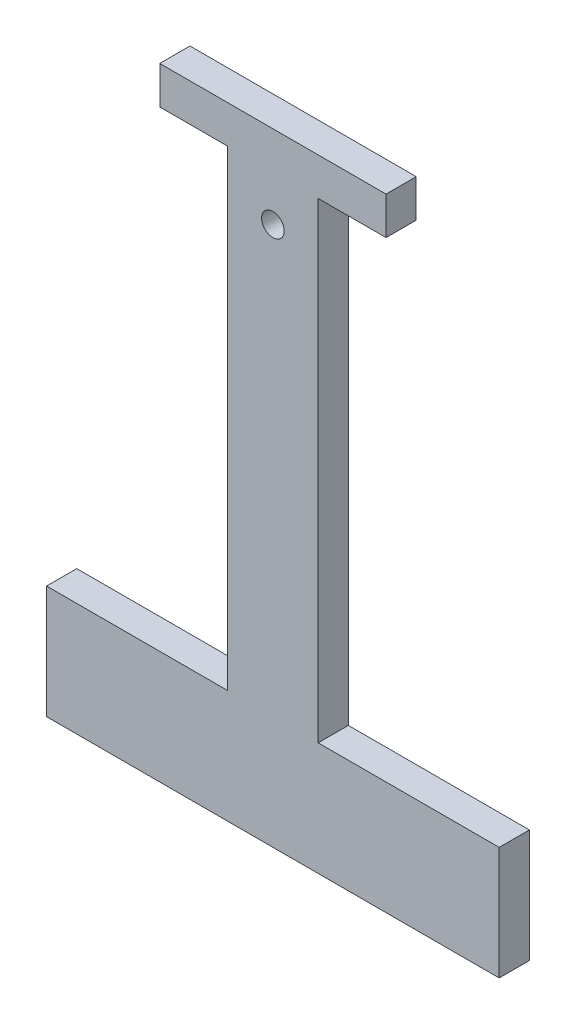
ISO-10303-21;
HEADER;
FILE_DESCRIPTION(('STEP AP214'),'2;1');
FILE_NAME('part.step','',(''),(''),'','','');
FILE_SCHEMA(('AUTOMOTIVE_DESIGN { 1 0 10303 214 1 1 1 1 }'));
ENDSEC;
DATA;
#1=APPLICATION_CONTEXT('core data for automotive mechanical design processes');
#2=APPLICATION_PROTOCOL_DEFINITION('international standard','automotive_design',2000,#1);
#3=PRODUCT_CONTEXT('',#1,'mechanical');
#4=PRODUCT('Part','Part','',(#3));
#5=PRODUCT_RELATED_PRODUCT_CATEGORY('part','',(#4));
#6=PRODUCT_DEFINITION_FORMATION('','',#4);
#7=PRODUCT_DEFINITION_CONTEXT('part definition',#1,'design');
#8=PRODUCT_DEFINITION('design','',#6,#7);
#9=PRODUCT_DEFINITION_SHAPE('','',#8);
#10=(LENGTH_UNIT() NAMED_UNIT(*) SI_UNIT(.MILLI.,.METRE.));
#11=(NAMED_UNIT(*) PLANE_ANGLE_UNIT() SI_UNIT($,.RADIAN.));
#12=(NAMED_UNIT(*) SI_UNIT($,.STERADIAN.) SOLID_ANGLE_UNIT());
#13=UNCERTAINTY_MEASURE_WITH_UNIT(LENGTH_MEASURE(1.E-05),#10,'distance_accuracy_value','');
#14=(GEOMETRIC_REPRESENTATION_CONTEXT(3) GLOBAL_UNCERTAINTY_ASSIGNED_CONTEXT((#13)) GLOBAL_UNIT_ASSIGNED_CONTEXT((#10,
#11,#12)) REPRESENTATION_CONTEXT('',''));
#15=CARTESIAN_POINT('',(0.,0.,0.));
#16=DIRECTION('',(0.,0.,1.));
#17=DIRECTION('',(1.,0.,0.));
#18=AXIS2_PLACEMENT_3D('',#15,#16,#17);
#19=CARTESIAN_POINT('',(0.,0.,4.));
#20=DIRECTION('',(0.,0.,1.));
#21=DIRECTION('',(1.,0.,0.));
#22=AXIS2_PLACEMENT_3D('',#19,#20,#21);
#23=PLANE('',#22);
#24=DIRECTION('',(-1.,0.,0.));
#25=VECTOR('',#24,1.);
#26=CARTESIAN_POINT('',(5.70816552104222,7.5,4.));
#27=LINE('',#26,#25);
#28=CARTESIAN_POINT('',(29.7081655210422,7.5,4.));
#29=VERTEX_POINT('',#28);
#30=CARTESIAN_POINT('',(5.70816552104222,7.5,4.));
#31=VERTEX_POINT('',#30);
#32=EDGE_CURVE('E200',#29,#31,#27,.T.);
#33=ORIENTED_EDGE('',*,*,#32,.T.);
#34=DIRECTION('',(0.,1.,0.));
#35=VECTOR('',#34,1.);
#36=CARTESIAN_POINT('',(5.70816552104222,7.5,4.));
#37=LINE('',#36,#35);
#38=CARTESIAN_POINT('',(5.70816552104222,70.,4.));
#39=VERTEX_POINT('',#38);
#40=EDGE_CURVE('E112',#31,#39,#37,.T.);
#41=ORIENTED_EDGE('',*,*,#40,.T.);
#42=DIRECTION('',(1.,0.,0.));
#43=VECTOR('',#42,1.);
#44=CARTESIAN_POINT('',(5.70816552104222,70.,4.));
#45=LINE('',#44,#43);
#46=CARTESIAN_POINT('',(14.7081655210422,70.,4.));
#47=VERTEX_POINT('',#46);
#48=EDGE_CURVE('E237',#39,#47,#45,.T.);
#49=ORIENTED_EDGE('',*,*,#48,.T.);
#50=DIRECTION('',(0.,1.,0.));
#51=VECTOR('',#50,1.);
#52=CARTESIAN_POINT('',(14.7081655210422,70.,4.));
#53=LINE('',#52,#51);
#54=CARTESIAN_POINT('',(14.7081655210422,75.,4.));
#55=VERTEX_POINT('',#54);
#56=EDGE_CURVE('E257',#47,#55,#53,.T.);
#57=ORIENTED_EDGE('',*,*,#56,.T.);
#58=DIRECTION('',(-1.,0.,0.));
#59=VECTOR('',#58,1.);
#60=CARTESIAN_POINT('',(-15.2918344789578,75.,4.));
#61=LINE('',#60,#59);
#62=CARTESIAN_POINT('',(-15.2918344789578,75.,4.));
#63=VERTEX_POINT('',#62);
#64=EDGE_CURVE('E253',#55,#63,#61,.T.);
#65=ORIENTED_EDGE('',*,*,#64,.T.);
#66=DIRECTION('',(0.,-1.,0.));
#67=VECTOR('',#66,1.);
#68=CARTESIAN_POINT('',(-15.2918344789578,70.,4.));
#69=LINE('',#68,#67);
#70=CARTESIAN_POINT('',(-15.2918344789578,70.,4.));
#71=VERTEX_POINT('',#70);
#72=EDGE_CURVE('E256',#63,#71,#69,.T.);
#73=ORIENTED_EDGE('',*,*,#72,.T.);
#74=DIRECTION('',(1.,0.,0.));
#75=VECTOR('',#74,1.);
#76=CARTESIAN_POINT('',(-15.2918344789578,70.,4.));
#77=LINE('',#76,#75);
#78=CARTESIAN_POINT('',(-6.29183447895778,70.,4.));
#79=VERTEX_POINT('',#78);
#80=EDGE_CURVE('E261',#71,#79,#77,.T.);
#81=ORIENTED_EDGE('',*,*,#80,.T.);
#82=DIRECTION('',(0.,-1.,0.));
#83=VECTOR('',#82,1.);
#84=CARTESIAN_POINT('',(-6.29183447895778,7.5,4.));
#85=LINE('',#84,#83);
#86=CARTESIAN_POINT('',(-6.29183447895778,7.5,4.));
#87=VERTEX_POINT('',#86);
#88=EDGE_CURVE('E268',#79,#87,#85,.T.);
#89=ORIENTED_EDGE('',*,*,#88,.T.);
#90=DIRECTION('',(-1.,0.,0.));
#91=VECTOR('',#90,1.);
#92=CARTESIAN_POINT('',(-30.2918344789578,7.5,4.));
#93=LINE('',#92,#91);
#94=CARTESIAN_POINT('',(-30.2918344789578,7.5,4.));
#95=VERTEX_POINT('',#94);
#96=EDGE_CURVE('E143',#87,#95,#93,.T.);
#97=ORIENTED_EDGE('',*,*,#96,.T.);
#98=DIRECTION('',(0.,-1.,0.));
#99=VECTOR('',#98,1.);
#100=CARTESIAN_POINT('',(-30.2918344789578,-7.5,4.));
#101=LINE('',#100,#99);
#102=CARTESIAN_POINT('',(-30.2918344789578,-7.5,4.));
#103=VERTEX_POINT('',#102);
#104=EDGE_CURVE('E137',#95,#103,#101,.T.);
#105=ORIENTED_EDGE('',*,*,#104,.T.);
#106=DIRECTION('',(1.,0.,0.));
#107=VECTOR('',#106,1.);
#108=CARTESIAN_POINT('',(-30.2918344789578,-7.5,4.));
#109=LINE('',#108,#107);
#110=CARTESIAN_POINT('',(29.7081655210422,-7.5,4.));
#111=VERTEX_POINT('',#110);
#112=EDGE_CURVE('E141',#103,#111,#109,.T.);
#113=ORIENTED_EDGE('',*,*,#112,.T.);
#114=DIRECTION('',(0.,1.,0.));
#115=VECTOR('',#114,1.);
#116=CARTESIAN_POINT('',(29.7081655210422,-7.5,4.));
#117=LINE('',#116,#115);
#118=EDGE_CURVE('E57',#111,#29,#117,.T.);
#119=ORIENTED_EDGE('',*,*,#118,.T.);
#120=EDGE_LOOP('',(#33,#41,#49,#57,#65,#73,#81,#89,#97,#105,#113,#119));
#121=FACE_BOUND('',#120,.T.);
#122=CARTESIAN_POINT('',(-0.291834478957779,64.,4.));
#123=DIRECTION('',(0.,0.,1.));
#124=DIRECTION('',(1.,0.,0.));
#125=AXIS2_PLACEMENT_3D('',#122,#123,#124);
#126=CIRCLE('',#125,1.5);
#127=CARTESIAN_POINT('',(1.20816552104222,64.,4.));
#128=VERTEX_POINT('',#127);
#129=EDGE_CURVE('E170',#128,#128,#126,.T.);
#130=ORIENTED_EDGE('',*,*,#129,.F.);
#131=EDGE_LOOP('',(#130));
#132=FACE_BOUND('',#131,.T.);
#133=ADVANCED_FACE('F39',(#121,#132),#23,.T.);
#134=CARTESIAN_POINT('',(0.,0.,0.));
#135=DIRECTION('',(0.,0.,1.));
#136=DIRECTION('',(1.,0.,0.));
#137=AXIS2_PLACEMENT_3D('',#134,#135,#136);
#138=PLANE('',#137);
#139=DIRECTION('',(-1.,0.,0.));
#140=VECTOR('',#139,1.);
#141=CARTESIAN_POINT('',(5.70816552104222,7.5,0.));
#142=LINE('',#141,#140);
#143=CARTESIAN_POINT('',(29.7081655210422,7.5,0.));
#144=VERTEX_POINT('',#143);
#145=CARTESIAN_POINT('',(5.70816552104222,7.5,0.));
#146=VERTEX_POINT('',#145);
#147=EDGE_CURVE('E165',#144,#146,#142,.T.);
#148=ORIENTED_EDGE('',*,*,#147,.F.);
#149=DIRECTION('',(0.,1.,0.));
#150=VECTOR('',#149,1.);
#151=CARTESIAN_POINT('',(29.7081655210422,-7.5,0.));
#152=LINE('',#151,#150);
#153=CARTESIAN_POINT('',(29.7081655210422,-7.5,0.));
#154=VERTEX_POINT('',#153);
#155=EDGE_CURVE('E104',#154,#144,#152,.T.);
#156=ORIENTED_EDGE('',*,*,#155,.F.);
#157=DIRECTION('',(1.,0.,0.));
#158=VECTOR('',#157,1.);
#159=CARTESIAN_POINT('',(-30.2918344789578,-7.5,0.));
#160=LINE('',#159,#158);
#161=CARTESIAN_POINT('',(-30.2918344789578,-7.5,0.));
#162=VERTEX_POINT('',#161);
#163=EDGE_CURVE('E98',#162,#154,#160,.T.);
#164=ORIENTED_EDGE('',*,*,#163,.F.);
#165=DIRECTION('',(0.,-1.,0.));
#166=VECTOR('',#165,1.);
#167=CARTESIAN_POINT('',(-30.2918344789578,-7.5,0.));
#168=LINE('',#167,#166);
#169=CARTESIAN_POINT('',(-30.2918344789578,7.5,0.));
#170=VERTEX_POINT('',#169);
#171=EDGE_CURVE('E152',#170,#162,#168,.T.);
#172=ORIENTED_EDGE('',*,*,#171,.F.);
#173=DIRECTION('',(-1.,0.,0.));
#174=VECTOR('',#173,1.);
#175=CARTESIAN_POINT('',(-30.2918344789578,7.5,0.));
#176=LINE('',#175,#174);
#177=CARTESIAN_POINT('',(-6.29183447895778,7.5,0.));
#178=VERTEX_POINT('',#177);
#179=EDGE_CURVE('E191',#178,#170,#176,.T.);
#180=ORIENTED_EDGE('',*,*,#179,.F.);
#181=DIRECTION('',(0.,-1.,0.));
#182=VECTOR('',#181,1.);
#183=CARTESIAN_POINT('',(-6.29183447895778,7.5,0.));
#184=LINE('',#183,#182);
#185=CARTESIAN_POINT('',(-6.29183447895778,70.,0.));
#186=VERTEX_POINT('',#185);
#187=EDGE_CURVE('E188',#186,#178,#184,.T.);
#188=ORIENTED_EDGE('',*,*,#187,.F.);
#189=DIRECTION('',(1.,0.,0.));
#190=VECTOR('',#189,1.);
#191=CARTESIAN_POINT('',(-15.2918344789578,70.,0.));
#192=LINE('',#191,#190);
#193=CARTESIAN_POINT('',(-15.2918344789578,70.,0.));
#194=VERTEX_POINT('',#193);
#195=EDGE_CURVE('E185',#194,#186,#192,.T.);
#196=ORIENTED_EDGE('',*,*,#195,.F.);
#197=DIRECTION('',(0.,-1.,0.));
#198=VECTOR('',#197,1.);
#199=CARTESIAN_POINT('',(-15.2918344789578,70.,0.));
#200=LINE('',#199,#198);
#201=CARTESIAN_POINT('',(-15.2918344789578,75.,0.));
#202=VERTEX_POINT('',#201);
#203=EDGE_CURVE('E182',#202,#194,#200,.T.);
#204=ORIENTED_EDGE('',*,*,#203,.F.);
#205=DIRECTION('',(-1.,0.,0.));
#206=VECTOR('',#205,1.);
#207=CARTESIAN_POINT('',(-15.2918344789578,75.,0.));
#208=LINE('',#207,#206);
#209=CARTESIAN_POINT('',(14.7081655210422,75.,0.));
#210=VERTEX_POINT('',#209);
#211=EDGE_CURVE('E179',#210,#202,#208,.T.);
#212=ORIENTED_EDGE('',*,*,#211,.F.);
#213=DIRECTION('',(0.,1.,0.));
#214=VECTOR('',#213,1.);
#215=CARTESIAN_POINT('',(14.7081655210422,70.,0.));
#216=LINE('',#215,#214);
#217=CARTESIAN_POINT('',(14.7081655210422,70.,0.));
#218=VERTEX_POINT('',#217);
#219=EDGE_CURVE('E176',#218,#210,#216,.T.);
#220=ORIENTED_EDGE('',*,*,#219,.F.);
#221=DIRECTION('',(1.,0.,0.));
#222=VECTOR('',#221,1.);
#223=CARTESIAN_POINT('',(5.70816552104222,70.,0.));
#224=LINE('',#223,#222);
#225=CARTESIAN_POINT('',(5.70816552104222,70.,0.));
#226=VERTEX_POINT('',#225);
#227=EDGE_CURVE('E173',#226,#218,#224,.T.);
#228=ORIENTED_EDGE('',*,*,#227,.F.);
#229=DIRECTION('',(0.,1.,0.));
#230=VECTOR('',#229,1.);
#231=CARTESIAN_POINT('',(5.70816552104222,7.5,0.));
#232=LINE('',#231,#230);
#233=EDGE_CURVE('E169',#146,#226,#232,.T.);
#234=ORIENTED_EDGE('',*,*,#233,.F.);
#235=EDGE_LOOP('',(#148,#156,#164,#172,#180,#188,#196,#204,#212,#220,#228,#234));
#236=FACE_BOUND('',#235,.T.);
#237=CARTESIAN_POINT('',(-0.291834478957779,64.,0.));
#238=DIRECTION('',(0.,0.,1.));
#239=DIRECTION('',(1.,0.,0.));
#240=AXIS2_PLACEMENT_3D('',#237,#238,#239);
#241=CIRCLE('',#240,1.5);
#242=CARTESIAN_POINT('',(1.20816552104222,64.,0.));
#243=VERTEX_POINT('',#242);
#244=EDGE_CURVE('E417',#243,#243,#241,.T.);
#245=ORIENTED_EDGE('',*,*,#244,.T.);
#246=EDGE_LOOP('',(#245));
#247=FACE_BOUND('',#246,.T.);
#248=ADVANCED_FACE('F241',(#236,#247),#138,.F.);
#249=CARTESIAN_POINT('',(5.70816552104222,7.5,4.));
#250=DIRECTION('',(0.,-1.,0.));
#251=DIRECTION('',(0.,0.,-1.));
#252=AXIS2_PLACEMENT_3D('',#249,#250,#251);
#253=PLANE('',#252);
#254=ORIENTED_EDGE('',*,*,#147,.T.);
#255=DIRECTION('',(0.,0.,-1.));
#256=VECTOR('',#255,1.);
#257=CARTESIAN_POINT('',(5.70816552104222,7.5,4.));
#258=LINE('',#257,#256);
#259=EDGE_CURVE('E11',#31,#146,#258,.T.);
#260=ORIENTED_EDGE('',*,*,#259,.F.);
#261=ORIENTED_EDGE('',*,*,#32,.F.);
#262=DIRECTION('',(0.,0.,-1.));
#263=VECTOR('',#262,1.);
#264=CARTESIAN_POINT('',(29.7081655210422,7.5,4.));
#265=LINE('',#264,#263);
#266=EDGE_CURVE('E161',#29,#144,#265,.T.);
#267=ORIENTED_EDGE('',*,*,#266,.T.);
#268=EDGE_LOOP('',(#254,#260,#261,#267));
#269=FACE_BOUND('',#268,.T.);
#270=ADVANCED_FACE('F41',(#269),#253,.F.);
#271=CARTESIAN_POINT('',(5.70816552104222,7.5,4.));
#272=DIRECTION('',(-1.,0.,0.));
#273=DIRECTION('',(0.,-1.,0.));
#274=AXIS2_PLACEMENT_3D('',#271,#272,#273);
#275=PLANE('',#274);
#276=ORIENTED_EDGE('',*,*,#233,.T.);
#277=DIRECTION('',(0.,0.,-1.));
#278=VECTOR('',#277,1.);
#279=CARTESIAN_POINT('',(5.70816552104222,70.,4.));
#280=LINE('',#279,#278);
#281=EDGE_CURVE('E49',#39,#226,#280,.T.);
#282=ORIENTED_EDGE('',*,*,#281,.F.);
#283=ORIENTED_EDGE('',*,*,#40,.F.);
#284=ORIENTED_EDGE('',*,*,#259,.T.);
#285=EDGE_LOOP('',(#276,#282,#283,#284));
#286=FACE_BOUND('',#285,.T.);
#287=ADVANCED_FACE('F304',(#286),#275,.F.);
#288=CARTESIAN_POINT('',(5.70816552104222,70.,4.));
#289=DIRECTION('',(0.,1.,0.));
#290=DIRECTION('',(0.,0.,1.));
#291=AXIS2_PLACEMENT_3D('',#288,#289,#290);
#292=PLANE('',#291);
#293=ORIENTED_EDGE('',*,*,#227,.T.);
#294=DIRECTION('',(0.,0.,-1.));
#295=VECTOR('',#294,1.);
#296=CARTESIAN_POINT('',(14.7081655210422,70.,4.));
#297=LINE('',#296,#295);
#298=EDGE_CURVE('E227',#47,#218,#297,.T.);
#299=ORIENTED_EDGE('',*,*,#298,.F.);
#300=ORIENTED_EDGE('',*,*,#48,.F.);
#301=ORIENTED_EDGE('',*,*,#281,.T.);
#302=EDGE_LOOP('',(#293,#299,#300,#301));
#303=FACE_BOUND('',#302,.T.);
#304=ADVANCED_FACE('F235',(#303),#292,.F.);
#305=CARTESIAN_POINT('',(14.7081655210422,70.,4.));
#306=DIRECTION('',(-1.,0.,0.));
#307=DIRECTION('',(0.,0.,1.));
#308=AXIS2_PLACEMENT_3D('',#305,#306,#307);
#309=PLANE('',#308);
#310=ORIENTED_EDGE('',*,*,#219,.T.);
#311=DIRECTION('',(0.,0.,-1.));
#312=VECTOR('',#311,1.);
#313=CARTESIAN_POINT('',(14.7081655210422,75.,4.));
#314=LINE('',#313,#312);
#315=EDGE_CURVE('E223',#55,#210,#314,.T.);
#316=ORIENTED_EDGE('',*,*,#315,.F.);
#317=ORIENTED_EDGE('',*,*,#56,.F.);
#318=ORIENTED_EDGE('',*,*,#298,.T.);
#319=EDGE_LOOP('',(#310,#316,#317,#318));
#320=FACE_BOUND('',#319,.T.);
#321=ADVANCED_FACE('F247',(#320),#309,.F.);
#322=CARTESIAN_POINT('',(-15.2918344789578,75.,4.));
#323=DIRECTION('',(0.,-1.,0.));
#324=DIRECTION('',(0.,0.,-1.));
#325=AXIS2_PLACEMENT_3D('',#322,#323,#324);
#326=PLANE('',#325);
#327=ORIENTED_EDGE('',*,*,#211,.T.);
#328=DIRECTION('',(0.,0.,-1.));
#329=VECTOR('',#328,1.);
#330=CARTESIAN_POINT('',(-15.2918344789578,75.,4.));
#331=LINE('',#330,#329);
#332=EDGE_CURVE('E219',#63,#202,#331,.T.);
#333=ORIENTED_EDGE('',*,*,#332,.F.);
#334=ORIENTED_EDGE('',*,*,#64,.F.);
#335=ORIENTED_EDGE('',*,*,#315,.T.);
#336=EDGE_LOOP('',(#327,#333,#334,#335));
#337=FACE_BOUND('',#336,.T.);
#338=ADVANCED_FACE('F251',(#337),#326,.F.);
#339=CARTESIAN_POINT('',(-15.2918344789578,70.,4.));
#340=DIRECTION('',(1.,0.,0.));
#341=DIRECTION('',(0.,0.,-1.));
#342=AXIS2_PLACEMENT_3D('',#339,#340,#341);
#343=PLANE('',#342);
#344=ORIENTED_EDGE('',*,*,#203,.T.);
#345=DIRECTION('',(0.,0.,-1.));
#346=VECTOR('',#345,1.);
#347=CARTESIAN_POINT('',(-15.2918344789578,70.,4.));
#348=LINE('',#347,#346);
#349=EDGE_CURVE('E215',#71,#194,#348,.T.);
#350=ORIENTED_EDGE('',*,*,#349,.F.);
#351=ORIENTED_EDGE('',*,*,#72,.F.);
#352=ORIENTED_EDGE('',*,*,#332,.T.);
#353=EDGE_LOOP('',(#344,#350,#351,#352));
#354=FACE_BOUND('',#353,.T.);
#355=ADVANCED_FACE('F317',(#354),#343,.F.);
#356=CARTESIAN_POINT('',(-15.2918344789578,70.,4.));
#357=DIRECTION('',(0.,1.,0.));
#358=DIRECTION('',(0.,0.,1.));
#359=AXIS2_PLACEMENT_3D('',#356,#357,#358);
#360=PLANE('',#359);
#361=ORIENTED_EDGE('',*,*,#195,.T.);
#362=DIRECTION('',(0.,0.,-1.));
#363=VECTOR('',#362,1.);
#364=CARTESIAN_POINT('',(-6.29183447895778,70.,4.));
#365=LINE('',#364,#363);
#366=EDGE_CURVE('E211',#79,#186,#365,.T.);
#367=ORIENTED_EDGE('',*,*,#366,.F.);
#368=ORIENTED_EDGE('',*,*,#80,.F.);
#369=ORIENTED_EDGE('',*,*,#349,.T.);
#370=EDGE_LOOP('',(#361,#367,#368,#369));
#371=FACE_BOUND('',#370,.T.);
#372=ADVANCED_FACE('F320',(#371),#360,.F.);
#373=CARTESIAN_POINT('',(-6.29183447895778,7.5,4.));
#374=DIRECTION('',(1.,0.,0.));
#375=DIRECTION('',(0.,0.,-1.));
#376=AXIS2_PLACEMENT_3D('',#373,#374,#375);
#377=PLANE('',#376);
#378=ORIENTED_EDGE('',*,*,#187,.T.);
#379=DIRECTION('',(0.,0.,-1.));
#380=VECTOR('',#379,1.);
#381=CARTESIAN_POINT('',(-6.29183447895778,7.5,4.));
#382=LINE('',#381,#380);
#383=EDGE_CURVE('E207',#87,#178,#382,.T.);
#384=ORIENTED_EDGE('',*,*,#383,.F.);
#385=ORIENTED_EDGE('',*,*,#88,.F.);
#386=ORIENTED_EDGE('',*,*,#366,.T.);
#387=EDGE_LOOP('',(#378,#384,#385,#386));
#388=FACE_BOUND('',#387,.T.);
#389=ADVANCED_FACE('F276',(#388),#377,.F.);
#390=CARTESIAN_POINT('',(-30.2918344789578,7.5,4.));
#391=DIRECTION('',(0.,-1.,0.));
#392=DIRECTION('',(0.,0.,-1.));
#393=AXIS2_PLACEMENT_3D('',#390,#391,#392);
#394=PLANE('',#393);
#395=ORIENTED_EDGE('',*,*,#179,.T.);
#396=DIRECTION('',(0.,0.,-1.));
#397=VECTOR('',#396,1.);
#398=CARTESIAN_POINT('',(-30.2918344789578,7.5,4.));
#399=LINE('',#398,#397);
#400=EDGE_CURVE('E154',#95,#170,#399,.T.);
#401=ORIENTED_EDGE('',*,*,#400,.F.);
#402=ORIENTED_EDGE('',*,*,#96,.F.);
#403=ORIENTED_EDGE('',*,*,#383,.T.);
#404=EDGE_LOOP('',(#395,#401,#402,#403));
#405=FACE_BOUND('',#404,.T.);
#406=ADVANCED_FACE('F280',(#405),#394,.F.);
#407=CARTESIAN_POINT('',(-30.2918344789578,-7.5,4.));
#408=DIRECTION('',(1.,0.,0.));
#409=DIRECTION('',(0.,0.,-1.));
#410=AXIS2_PLACEMENT_3D('',#407,#408,#409);
#411=PLANE('',#410);
#412=ORIENTED_EDGE('',*,*,#171,.T.);
#413=DIRECTION('',(0.,0.,-1.));
#414=VECTOR('',#413,1.);
#415=CARTESIAN_POINT('',(-30.2918344789578,-7.5,4.));
#416=LINE('',#415,#414);
#417=EDGE_CURVE('E149',#103,#162,#416,.T.);
#418=ORIENTED_EDGE('',*,*,#417,.F.);
#419=ORIENTED_EDGE('',*,*,#104,.F.);
#420=ORIENTED_EDGE('',*,*,#400,.T.);
#421=EDGE_LOOP('',(#412,#418,#419,#420));
#422=FACE_BOUND('',#421,.T.);
#423=ADVANCED_FACE('F150',(#422),#411,.F.);
#424=CARTESIAN_POINT('',(-30.2918344789578,-7.5,4.));
#425=DIRECTION('',(0.,1.,0.));
#426=DIRECTION('',(0.,0.,1.));
#427=AXIS2_PLACEMENT_3D('',#424,#425,#426);
#428=PLANE('',#427);
#429=ORIENTED_EDGE('',*,*,#163,.T.);
#430=DIRECTION('',(0.,0.,-1.));
#431=VECTOR('',#430,1.);
#432=CARTESIAN_POINT('',(29.7081655210422,-7.5,4.));
#433=LINE('',#432,#431);
#434=EDGE_CURVE('E155',#111,#154,#433,.T.);
#435=ORIENTED_EDGE('',*,*,#434,.F.);
#436=ORIENTED_EDGE('',*,*,#112,.F.);
#437=ORIENTED_EDGE('',*,*,#417,.T.);
#438=EDGE_LOOP('',(#429,#435,#436,#437));
#439=FACE_BOUND('',#438,.T.);
#440=ADVANCED_FACE('F157',(#439),#428,.F.);
#441=CARTESIAN_POINT('',(29.7081655210422,-7.5,4.));
#442=DIRECTION('',(-1.,0.,0.));
#443=DIRECTION('',(0.,0.,1.));
#444=AXIS2_PLACEMENT_3D('',#441,#442,#443);
#445=PLANE('',#444);
#446=ORIENTED_EDGE('',*,*,#155,.T.);
#447=ORIENTED_EDGE('',*,*,#266,.F.);
#448=ORIENTED_EDGE('',*,*,#118,.F.);
#449=ORIENTED_EDGE('',*,*,#434,.T.);
#450=EDGE_LOOP('',(#446,#447,#448,#449));
#451=FACE_BOUND('',#450,.T.);
#452=ADVANCED_FACE('F284',(#451),#445,.F.);
#453=CARTESIAN_POINT('',(-0.291834478957779,64.,4.));
#454=DIRECTION('',(0.,0.,-1.));
#455=DIRECTION('',(-1.,0.,0.));
#456=AXIS2_PLACEMENT_3D('',#453,#454,#455);
#457=CYLINDRICAL_SURFACE('',#456,1.5);
#458=ORIENTED_EDGE('',*,*,#129,.T.);
#459=EDGE_LOOP('',(#458));
#460=FACE_BOUND('',#459,.T.);
#461=ORIENTED_EDGE('',*,*,#244,.F.);
#462=EDGE_LOOP('',(#461));
#463=FACE_BOUND('',#462,.T.);
#464=ADVANCED_FACE('F286',(#460,#463),#457,.F.);
#465=CLOSED_SHELL('',(#133,#248,#270,#287,#304,#321,#338,#355,#372,#389,#406,#423,#440,#452,#464));
#466=MANIFOLD_SOLID_BREP('B2',#465);
#467=ADVANCED_BREP_SHAPE_REPRESENTATION('',(#18,#466),#14);
#468=SHAPE_DEFINITION_REPRESENTATION(#9,#467);
ENDSEC;
END-ISO-10303-21;
